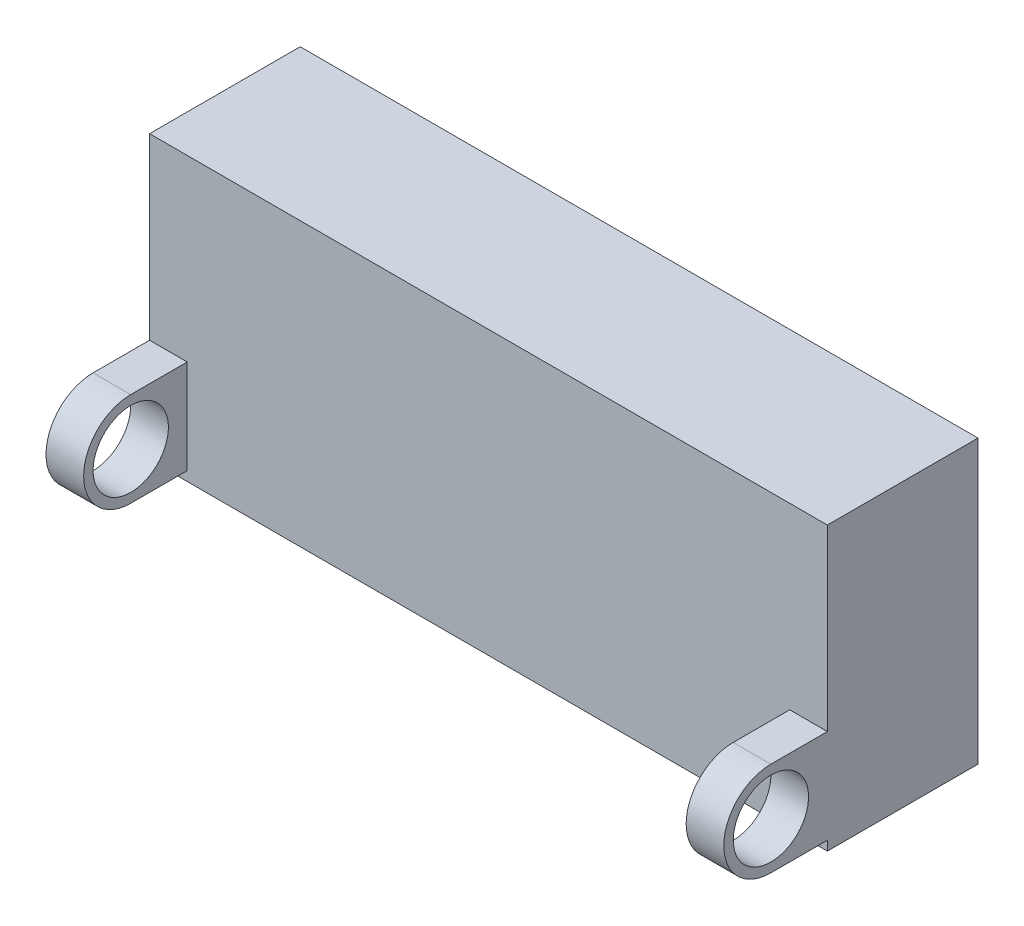
ISO-10303-21;
HEADER;
FILE_DESCRIPTION(('STEP AP214'),'2;1');
FILE_NAME('part.step','',(''),(''),'','','');
FILE_SCHEMA(('AUTOMOTIVE_DESIGN { 1 0 10303 214 1 1 1 1 }'));
ENDSEC;
DATA;
#1=APPLICATION_CONTEXT('core data for automotive mechanical design processes');
#2=APPLICATION_PROTOCOL_DEFINITION('international standard','automotive_design',2000,#1);
#3=PRODUCT_CONTEXT('',#1,'mechanical');
#4=PRODUCT('Part','Part','',(#3));
#5=PRODUCT_RELATED_PRODUCT_CATEGORY('part','',(#4));
#6=PRODUCT_DEFINITION_FORMATION('','',#4);
#7=PRODUCT_DEFINITION_CONTEXT('part definition',#1,'design');
#8=PRODUCT_DEFINITION('design','',#6,#7);
#9=PRODUCT_DEFINITION_SHAPE('','',#8);
#10=(LENGTH_UNIT() NAMED_UNIT(*) SI_UNIT(.MILLI.,.METRE.));
#11=(NAMED_UNIT(*) PLANE_ANGLE_UNIT() SI_UNIT($,.RADIAN.));
#12=(NAMED_UNIT(*) SI_UNIT($,.STERADIAN.) SOLID_ANGLE_UNIT());
#13=UNCERTAINTY_MEASURE_WITH_UNIT(LENGTH_MEASURE(1.E-05),#10,'distance_accuracy_value','');
#14=(GEOMETRIC_REPRESENTATION_CONTEXT(3) GLOBAL_UNCERTAINTY_ASSIGNED_CONTEXT((#13)) GLOBAL_UNIT_ASSIGNED_CONTEXT((#10,
#11,#12)) REPRESENTATION_CONTEXT('',''));
#15=CARTESIAN_POINT('',(0.,0.,0.));
#16=DIRECTION('',(0.,0.,1.));
#17=DIRECTION('',(1.,0.,0.));
#18=AXIS2_PLACEMENT_3D('',#15,#16,#17);
#19=CARTESIAN_POINT('',(0.,15.,8.));
#20=DIRECTION('',(0.,1.,0.));
#21=DIRECTION('',(0.,0.,1.));
#22=AXIS2_PLACEMENT_3D('',#19,#20,#21);
#23=PLANE('',#22);
#24=DIRECTION('',(1.,0.,0.));
#25=VECTOR('',#24,1.);
#26=CARTESIAN_POINT('',(0.,15.,0.));
#27=LINE('',#26,#25);
#28=CARTESIAN_POINT('',(0.,15.,0.));
#29=VERTEX_POINT('',#28);
#30=CARTESIAN_POINT('',(36.,15.,0.));
#31=VERTEX_POINT('',#30);
#32=EDGE_CURVE('E208',#29,#31,#27,.T.);
#33=ORIENTED_EDGE('',*,*,#32,.F.);
#34=DIRECTION('',(0.,0.,-1.));
#35=VECTOR('',#34,1.);
#36=CARTESIAN_POINT('',(0.,15.,8.));
#37=LINE('',#36,#35);
#38=CARTESIAN_POINT('',(0.,15.,8.));
#39=VERTEX_POINT('',#38);
#40=EDGE_CURVE('E13',#39,#29,#37,.T.);
#41=ORIENTED_EDGE('',*,*,#40,.F.);
#42=DIRECTION('',(1.,0.,0.));
#43=VECTOR('',#42,1.);
#44=CARTESIAN_POINT('',(0.,15.,8.));
#45=LINE('',#44,#43);
#46=CARTESIAN_POINT('',(36.,15.,8.));
#47=VERTEX_POINT('',#46);
#48=EDGE_CURVE('E215',#39,#47,#45,.T.);
#49=ORIENTED_EDGE('',*,*,#48,.T.);
#50=DIRECTION('',(0.,0.,-1.));
#51=VECTOR('',#50,1.);
#52=CARTESIAN_POINT('',(36.,15.,8.));
#53=LINE('',#52,#51);
#54=EDGE_CURVE('E51',#47,#31,#53,.T.);
#55=ORIENTED_EDGE('',*,*,#54,.T.);
#56=EDGE_LOOP('',(#33,#41,#49,#55));
#57=FACE_BOUND('',#56,.T.);
#58=ADVANCED_FACE('F48',(#57),#23,.T.);
#59=CARTESIAN_POINT('',(0.,0.,8.));
#60=DIRECTION('',(-1.,0.,0.));
#61=DIRECTION('',(0.,0.,1.));
#62=AXIS2_PLACEMENT_3D('',#59,#60,#61);
#63=PLANE('',#62);
#64=DIRECTION('',(0.,1.,0.));
#65=VECTOR('',#64,1.);
#66=CARTESIAN_POINT('',(0.,0.,0.));
#67=LINE('',#66,#65);
#68=CARTESIAN_POINT('',(0.,0.,0.));
#69=VERTEX_POINT('',#68);
#70=EDGE_CURVE('E218',#69,#29,#67,.T.);
#71=ORIENTED_EDGE('',*,*,#70,.F.);
#72=DIRECTION('',(0.,0.,-1.));
#73=VECTOR('',#72,1.);
#74=CARTESIAN_POINT('',(0.,0.,8.));
#75=LINE('',#74,#73);
#76=CARTESIAN_POINT('',(0.,0.,8.));
#77=VERTEX_POINT('',#76);
#78=EDGE_CURVE('E56',#77,#69,#75,.T.);
#79=ORIENTED_EDGE('',*,*,#78,.F.);
#80=DIRECTION('',(0.,1.,0.));
#81=VECTOR('',#80,1.);
#82=CARTESIAN_POINT('',(0.,0.,8.));
#83=LINE('',#82,#81);
#84=CARTESIAN_POINT('',(0.,0.500000000000002,8.));
#85=VERTEX_POINT('',#84);
#86=EDGE_CURVE('E224',#77,#85,#83,.T.);
#87=ORIENTED_EDGE('',*,*,#86,.T.);
#88=DIRECTION('',(0.,0.,1.));
#89=VECTOR('',#88,1.);
#90=CARTESIAN_POINT('',(0.,0.500000000000002,11.));
#91=LINE('',#90,#89);
#92=CARTESIAN_POINT('',(0.,0.500000000000002,11.));
#93=VERTEX_POINT('',#92);
#94=EDGE_CURVE('E189',#85,#93,#91,.T.);
#95=ORIENTED_EDGE('',*,*,#94,.T.);
#96=CARTESIAN_POINT('',(0.,3.,11.));
#97=DIRECTION('',(-1.,0.,0.));
#98=DIRECTION('',(0.,0.,1.));
#99=AXIS2_PLACEMENT_3D('',#96,#97,#98);
#100=CIRCLE('',#99,2.5);
#101=CARTESIAN_POINT('',(0.,5.5,11.));
#102=VERTEX_POINT('',#101);
#103=EDGE_CURVE('E182',#93,#102,#100,.T.);
#104=ORIENTED_EDGE('',*,*,#103,.T.);
#105=DIRECTION('',(0.,0.,-1.));
#106=VECTOR('',#105,1.);
#107=CARTESIAN_POINT('',(0.,5.5,11.));
#108=LINE('',#107,#106);
#109=CARTESIAN_POINT('',(0.,5.5,8.));
#110=VERTEX_POINT('',#109);
#111=EDGE_CURVE('E201',#102,#110,#108,.T.);
#112=ORIENTED_EDGE('',*,*,#111,.T.);
#113=EDGE_CURVE('E223',#110,#39,#83,.T.);
#114=ORIENTED_EDGE('',*,*,#113,.T.);
#115=ORIENTED_EDGE('',*,*,#40,.T.);
#116=EDGE_LOOP('',(#71,#79,#87,#95,#104,#112,#114,#115));
#117=FACE_BOUND('',#116,.T.);
#118=CARTESIAN_POINT('',(0.,3.,11.));
#119=DIRECTION('',(-1.,0.,0.));
#120=DIRECTION('',(0.,0.,1.));
#121=AXIS2_PLACEMENT_3D('',#118,#119,#120);
#122=CIRCLE('',#121,2.);
#123=CARTESIAN_POINT('',(0.,3.,13.));
#124=VERTEX_POINT('',#123);
#125=EDGE_CURVE('E175',#124,#124,#122,.T.);
#126=ORIENTED_EDGE('',*,*,#125,.F.);
#127=EDGE_LOOP('',(#126));
#128=FACE_BOUND('',#127,.T.);
#129=ADVANCED_FACE('F249',(#117,#128),#63,.T.);
#130=CARTESIAN_POINT('',(0.,0.,8.));
#131=DIRECTION('',(0.,1.,0.));
#132=DIRECTION('',(0.,0.,1.));
#133=AXIS2_PLACEMENT_3D('',#130,#131,#132);
#134=PLANE('',#133);
#135=DIRECTION('',(1.,0.,0.));
#136=VECTOR('',#135,1.);
#137=CARTESIAN_POINT('',(0.,0.,0.));
#138=LINE('',#137,#136);
#139=CARTESIAN_POINT('',(36.,0.,0.));
#140=VERTEX_POINT('',#139);
#141=EDGE_CURVE('E231',#69,#140,#138,.T.);
#142=ORIENTED_EDGE('',*,*,#141,.T.);
#143=DIRECTION('',(0.,0.,-1.));
#144=VECTOR('',#143,1.);
#145=CARTESIAN_POINT('',(36.,0.,8.));
#146=LINE('',#145,#144);
#147=CARTESIAN_POINT('',(36.,0.,8.));
#148=VERTEX_POINT('',#147);
#149=EDGE_CURVE('E235',#148,#140,#146,.T.);
#150=ORIENTED_EDGE('',*,*,#149,.F.);
#151=DIRECTION('',(1.,0.,0.));
#152=VECTOR('',#151,1.);
#153=CARTESIAN_POINT('',(0.,0.,8.));
#154=LINE('',#153,#152);
#155=EDGE_CURVE('E221',#77,#148,#154,.T.);
#156=ORIENTED_EDGE('',*,*,#155,.F.);
#157=ORIENTED_EDGE('',*,*,#78,.T.);
#158=EDGE_LOOP('',(#142,#150,#156,#157));
#159=FACE_BOUND('',#158,.T.);
#160=ADVANCED_FACE('F271',(#159),#134,.F.);
#161=CARTESIAN_POINT('',(36.,0.,8.));
#162=DIRECTION('',(-1.,0.,0.));
#163=DIRECTION('',(0.,0.,1.));
#164=AXIS2_PLACEMENT_3D('',#161,#162,#163);
#165=PLANE('',#164);
#166=DIRECTION('',(0.,1.,0.));
#167=VECTOR('',#166,1.);
#168=CARTESIAN_POINT('',(36.,0.,0.));
#169=LINE('',#168,#167);
#170=EDGE_CURVE('E229',#140,#31,#169,.T.);
#171=ORIENTED_EDGE('',*,*,#170,.T.);
#172=ORIENTED_EDGE('',*,*,#54,.F.);
#173=DIRECTION('',(0.,1.,0.));
#174=VECTOR('',#173,1.);
#175=CARTESIAN_POINT('',(36.,0.,8.));
#176=LINE('',#175,#174);
#177=CARTESIAN_POINT('',(36.,5.5,8.));
#178=VERTEX_POINT('',#177);
#179=EDGE_CURVE('E156',#178,#47,#176,.T.);
#180=ORIENTED_EDGE('',*,*,#179,.F.);
#181=DIRECTION('',(0.,0.,-1.));
#182=VECTOR('',#181,1.);
#183=CARTESIAN_POINT('',(36.,5.5,11.));
#184=LINE('',#183,#182);
#185=CARTESIAN_POINT('',(36.,5.5,11.));
#186=VERTEX_POINT('',#185);
#187=EDGE_CURVE('E138',#186,#178,#184,.T.);
#188=ORIENTED_EDGE('',*,*,#187,.F.);
#189=CARTESIAN_POINT('',(36.,3.,11.));
#190=DIRECTION('',(-1.,0.,0.));
#191=DIRECTION('',(0.,0.,1.));
#192=AXIS2_PLACEMENT_3D('',#189,#190,#191);
#193=CIRCLE('',#192,2.5);
#194=CARTESIAN_POINT('',(36.,0.500000000000003,11.));
#195=VERTEX_POINT('',#194);
#196=EDGE_CURVE('E153',#195,#186,#193,.T.);
#197=ORIENTED_EDGE('',*,*,#196,.F.);
#198=DIRECTION('',(0.,0.,1.));
#199=VECTOR('',#198,1.);
#200=CARTESIAN_POINT('',(36.,0.500000000000003,11.));
#201=LINE('',#200,#199);
#202=CARTESIAN_POINT('',(36.,0.500000000000001,8.));
#203=VERTEX_POINT('',#202);
#204=EDGE_CURVE('E145',#203,#195,#201,.T.);
#205=ORIENTED_EDGE('',*,*,#204,.F.);
#206=EDGE_CURVE('E219',#148,#203,#176,.T.);
#207=ORIENTED_EDGE('',*,*,#206,.F.);
#208=ORIENTED_EDGE('',*,*,#149,.T.);
#209=EDGE_LOOP('',(#171,#172,#180,#188,#197,#205,#207,#208));
#210=FACE_BOUND('',#209,.T.);
#211=CARTESIAN_POINT('',(36.,3.,11.));
#212=DIRECTION('',(-1.,0.,0.));
#213=DIRECTION('',(0.,0.,1.));
#214=AXIS2_PLACEMENT_3D('',#211,#212,#213);
#215=CIRCLE('',#214,2.);
#216=CARTESIAN_POINT('',(36.,3.,13.));
#217=VERTEX_POINT('',#216);
#218=EDGE_CURVE('E171',#217,#217,#215,.T.);
#219=ORIENTED_EDGE('',*,*,#218,.T.);
#220=EDGE_LOOP('',(#219));
#221=FACE_BOUND('',#220,.T.);
#222=ADVANCED_FACE('F150',(#210,#221),#165,.F.);
#223=CARTESIAN_POINT('',(0.,0.,8.));
#224=DIRECTION('',(0.,0.,1.));
#225=DIRECTION('',(1.,0.,0.));
#226=AXIS2_PLACEMENT_3D('',#223,#224,#225);
#227=PLANE('',#226);
#228=DIRECTION('',(-1.,0.,0.));
#229=VECTOR('',#228,1.);
#230=CARTESIAN_POINT('',(36.,0.500000000000001,8.));
#231=LINE('',#230,#229);
#232=CARTESIAN_POINT('',(34.,0.500000000000001,8.));
#233=VERTEX_POINT('',#232);
#234=EDGE_CURVE('E176',#203,#233,#231,.T.);
#235=ORIENTED_EDGE('',*,*,#234,.T.);
#236=DIRECTION('',(0.,-1.,0.));
#237=VECTOR('',#236,1.);
#238=CARTESIAN_POINT('',(34.,0.500000000000001,8.));
#239=LINE('',#238,#237);
#240=CARTESIAN_POINT('',(34.,5.5,8.));
#241=VERTEX_POINT('',#240);
#242=EDGE_CURVE('E64',#241,#233,#239,.T.);
#243=ORIENTED_EDGE('',*,*,#242,.F.);
#244=DIRECTION('',(-1.,0.,0.));
#245=VECTOR('',#244,1.);
#246=CARTESIAN_POINT('',(36.,5.5,8.));
#247=LINE('',#246,#245);
#248=EDGE_CURVE('E68',#178,#241,#247,.T.);
#249=ORIENTED_EDGE('',*,*,#248,.F.);
#250=ORIENTED_EDGE('',*,*,#179,.T.);
#251=ORIENTED_EDGE('',*,*,#48,.F.);
#252=ORIENTED_EDGE('',*,*,#113,.F.);
#253=DIRECTION('',(-1.,0.,0.));
#254=VECTOR('',#253,1.);
#255=CARTESIAN_POINT('',(2.,5.5,8.));
#256=LINE('',#255,#254);
#257=CARTESIAN_POINT('',(2.,5.5,8.));
#258=VERTEX_POINT('',#257);
#259=EDGE_CURVE('E212',#258,#110,#256,.T.);
#260=ORIENTED_EDGE('',*,*,#259,.F.);
#261=DIRECTION('',(0.,-1.,0.));
#262=VECTOR('',#261,1.);
#263=CARTESIAN_POINT('',(2.,0.500000000000002,8.));
#264=LINE('',#263,#262);
#265=CARTESIAN_POINT('',(2.,0.500000000000002,8.));
#266=VERTEX_POINT('',#265);
#267=EDGE_CURVE('E192',#258,#266,#264,.T.);
#268=ORIENTED_EDGE('',*,*,#267,.T.);
#269=DIRECTION('',(-1.,0.,0.));
#270=VECTOR('',#269,1.);
#271=CARTESIAN_POINT('',(2.,0.500000000000002,8.));
#272=LINE('',#271,#270);
#273=EDGE_CURVE('E209',#266,#85,#272,.T.);
#274=ORIENTED_EDGE('',*,*,#273,.T.);
#275=ORIENTED_EDGE('',*,*,#86,.F.);
#276=ORIENTED_EDGE('',*,*,#155,.T.);
#277=ORIENTED_EDGE('',*,*,#206,.T.);
#278=EDGE_LOOP('',(#235,#243,#249,#250,#251,#252,#260,#268,#274,#275,#276,#277));
#279=FACE_BOUND('',#278,.T.);
#280=ADVANCED_FACE('F253',(#279),#227,.T.);
#281=CARTESIAN_POINT('',(0.,0.,0.));
#282=DIRECTION('',(0.,0.,1.));
#283=DIRECTION('',(1.,0.,0.));
#284=AXIS2_PLACEMENT_3D('',#281,#282,#283);
#285=PLANE('',#284);
#286=ORIENTED_EDGE('',*,*,#32,.T.);
#287=ORIENTED_EDGE('',*,*,#170,.F.);
#288=ORIENTED_EDGE('',*,*,#141,.F.);
#289=ORIENTED_EDGE('',*,*,#70,.T.);
#290=EDGE_LOOP('',(#286,#287,#288,#289));
#291=FACE_BOUND('',#290,.T.);
#292=ADVANCED_FACE('F246',(#291),#285,.F.);
#293=CARTESIAN_POINT('',(2.,3.,11.));
#294=DIRECTION('',(-1.,0.,0.));
#295=DIRECTION('',(0.,0.,1.));
#296=AXIS2_PLACEMENT_3D('',#293,#294,#295);
#297=CYLINDRICAL_SURFACE('',#296,2.5);
#298=ORIENTED_EDGE('',*,*,#103,.F.);
#299=DIRECTION('',(-1.,0.,0.));
#300=VECTOR('',#299,1.);
#301=CARTESIAN_POINT('',(2.,0.500000000000002,11.));
#302=LINE('',#301,#300);
#303=CARTESIAN_POINT('',(2.,0.500000000000002,11.));
#304=VERTEX_POINT('',#303);
#305=EDGE_CURVE('E206',#304,#93,#302,.T.);
#306=ORIENTED_EDGE('',*,*,#305,.F.);
#307=CARTESIAN_POINT('',(2.,3.,11.));
#308=DIRECTION('',(-1.,0.,0.));
#309=DIRECTION('',(0.,0.,1.));
#310=AXIS2_PLACEMENT_3D('',#307,#308,#309);
#311=CIRCLE('',#310,2.5);
#312=CARTESIAN_POINT('',(2.,5.5,11.));
#313=VERTEX_POINT('',#312);
#314=EDGE_CURVE('E185',#304,#313,#311,.T.);
#315=ORIENTED_EDGE('',*,*,#314,.T.);
#316=DIRECTION('',(-1.,0.,0.));
#317=VECTOR('',#316,1.);
#318=CARTESIAN_POINT('',(2.,5.5,11.));
#319=LINE('',#318,#317);
#320=EDGE_CURVE('E198',#313,#102,#319,.T.);
#321=ORIENTED_EDGE('',*,*,#320,.T.);
#322=EDGE_LOOP('',(#298,#306,#315,#321));
#323=FACE_BOUND('',#322,.T.);
#324=ADVANCED_FACE('F261',(#323),#297,.T.);
#325=CARTESIAN_POINT('',(2.,0.500000000000002,11.));
#326=DIRECTION('',(0.,-1.,0.));
#327=DIRECTION('',(0.,0.,-1.));
#328=AXIS2_PLACEMENT_3D('',#325,#326,#327);
#329=PLANE('',#328);
#330=ORIENTED_EDGE('',*,*,#94,.F.);
#331=ORIENTED_EDGE('',*,*,#273,.F.);
#332=DIRECTION('',(0.,0.,1.));
#333=VECTOR('',#332,1.);
#334=CARTESIAN_POINT('',(2.,0.500000000000002,11.));
#335=LINE('',#334,#333);
#336=EDGE_CURVE('E195',#266,#304,#335,.T.);
#337=ORIENTED_EDGE('',*,*,#336,.T.);
#338=ORIENTED_EDGE('',*,*,#305,.T.);
#339=EDGE_LOOP('',(#330,#331,#337,#338));
#340=FACE_BOUND('',#339,.T.);
#341=ADVANCED_FACE('F267',(#340),#329,.T.);
#342=CARTESIAN_POINT('',(2.,5.5,11.));
#343=DIRECTION('',(0.,1.,0.));
#344=DIRECTION('',(0.,0.,1.));
#345=AXIS2_PLACEMENT_3D('',#342,#343,#344);
#346=PLANE('',#345);
#347=ORIENTED_EDGE('',*,*,#111,.F.);
#348=ORIENTED_EDGE('',*,*,#320,.F.);
#349=DIRECTION('',(0.,0.,-1.));
#350=VECTOR('',#349,1.);
#351=CARTESIAN_POINT('',(2.,5.5,11.));
#352=LINE('',#351,#350);
#353=EDGE_CURVE('E188',#313,#258,#352,.T.);
#354=ORIENTED_EDGE('',*,*,#353,.T.);
#355=ORIENTED_EDGE('',*,*,#259,.T.);
#356=EDGE_LOOP('',(#347,#348,#354,#355));
#357=FACE_BOUND('',#356,.T.);
#358=ADVANCED_FACE('F257',(#357),#346,.T.);
#359=CARTESIAN_POINT('',(2.,3.,11.));
#360=DIRECTION('',(-1.,0.,0.));
#361=DIRECTION('',(0.,0.,1.));
#362=AXIS2_PLACEMENT_3D('',#359,#360,#361);
#363=PLANE('',#362);
#364=CARTESIAN_POINT('',(2.,3.,11.));
#365=DIRECTION('',(-1.,0.,0.));
#366=DIRECTION('',(0.,0.,1.));
#367=AXIS2_PLACEMENT_3D('',#364,#365,#366);
#368=CIRCLE('',#367,2.);
#369=CARTESIAN_POINT('',(2.,3.,13.));
#370=VERTEX_POINT('',#369);
#371=EDGE_CURVE('E179',#370,#370,#368,.T.);
#372=ORIENTED_EDGE('',*,*,#371,.T.);
#373=EDGE_LOOP('',(#372));
#374=FACE_BOUND('',#373,.T.);
#375=ORIENTED_EDGE('',*,*,#314,.F.);
#376=ORIENTED_EDGE('',*,*,#336,.F.);
#377=ORIENTED_EDGE('',*,*,#267,.F.);
#378=ORIENTED_EDGE('',*,*,#353,.F.);
#379=EDGE_LOOP('',(#375,#376,#377,#378));
#380=FACE_BOUND('',#379,.T.);
#381=ADVANCED_FACE('F264',(#374,#380),#363,.F.);
#382=CARTESIAN_POINT('',(2.,3.,11.));
#383=DIRECTION('',(-1.,0.,0.));
#384=DIRECTION('',(0.,0.,1.));
#385=AXIS2_PLACEMENT_3D('',#382,#383,#384);
#386=CYLINDRICAL_SURFACE('',#385,2.);
#387=ORIENTED_EDGE('',*,*,#371,.F.);
#388=EDGE_LOOP('',(#387));
#389=FACE_BOUND('',#388,.T.);
#390=ORIENTED_EDGE('',*,*,#125,.T.);
#391=EDGE_LOOP('',(#390));
#392=FACE_BOUND('',#391,.T.);
#393=ADVANCED_FACE('F317',(#389,#392),#386,.F.);
#394=CARTESIAN_POINT('',(36.,3.,11.));
#395=DIRECTION('',(-1.,0.,0.));
#396=DIRECTION('',(0.,0.,1.));
#397=AXIS2_PLACEMENT_3D('',#394,#395,#396);
#398=CYLINDRICAL_SURFACE('',#397,2.5);
#399=CARTESIAN_POINT('',(34.,3.,11.));
#400=DIRECTION('',(-1.,0.,0.));
#401=DIRECTION('',(0.,0.,1.));
#402=AXIS2_PLACEMENT_3D('',#399,#400,#401);
#403=CIRCLE('',#402,2.5);
#404=CARTESIAN_POINT('',(34.,0.500000000000003,11.));
#405=VERTEX_POINT('',#404);
#406=CARTESIAN_POINT('',(34.,5.5,11.));
#407=VERTEX_POINT('',#406);
#408=EDGE_CURVE('E169',#405,#407,#403,.T.);
#409=ORIENTED_EDGE('',*,*,#408,.F.);
#410=DIRECTION('',(-1.,0.,0.));
#411=VECTOR('',#410,1.);
#412=CARTESIAN_POINT('',(36.,0.500000000000003,11.));
#413=LINE('',#412,#411);
#414=EDGE_CURVE('E159',#195,#405,#413,.T.);
#415=ORIENTED_EDGE('',*,*,#414,.F.);
#416=ORIENTED_EDGE('',*,*,#196,.T.);
#417=DIRECTION('',(-1.,0.,0.));
#418=VECTOR('',#417,1.);
#419=CARTESIAN_POINT('',(36.,5.5,11.));
#420=LINE('',#419,#418);
#421=EDGE_CURVE('E135',#186,#407,#420,.T.);
#422=ORIENTED_EDGE('',*,*,#421,.T.);
#423=EDGE_LOOP('',(#409,#415,#416,#422));
#424=FACE_BOUND('',#423,.T.);
#425=ADVANCED_FACE('F158',(#424),#398,.T.);
#426=CARTESIAN_POINT('',(36.,0.500000000000003,11.));
#427=DIRECTION('',(0.,-1.,0.));
#428=DIRECTION('',(0.,0.,-1.));
#429=AXIS2_PLACEMENT_3D('',#426,#427,#428);
#430=PLANE('',#429);
#431=DIRECTION('',(0.,0.,1.));
#432=VECTOR('',#431,1.);
#433=CARTESIAN_POINT('',(34.,0.500000000000003,11.));
#434=LINE('',#433,#432);
#435=EDGE_CURVE('E160',#233,#405,#434,.T.);
#436=ORIENTED_EDGE('',*,*,#435,.F.);
#437=ORIENTED_EDGE('',*,*,#234,.F.);
#438=ORIENTED_EDGE('',*,*,#204,.T.);
#439=ORIENTED_EDGE('',*,*,#414,.T.);
#440=EDGE_LOOP('',(#436,#437,#438,#439));
#441=FACE_BOUND('',#440,.T.);
#442=ADVANCED_FACE('F274',(#441),#430,.T.);
#443=CARTESIAN_POINT('',(36.,5.5,11.));
#444=DIRECTION('',(0.,1.,0.));
#445=DIRECTION('',(0.,0.,1.));
#446=AXIS2_PLACEMENT_3D('',#443,#444,#445);
#447=PLANE('',#446);
#448=DIRECTION('',(0.,0.,-1.));
#449=VECTOR('',#448,1.);
#450=CARTESIAN_POINT('',(34.,5.5,11.));
#451=LINE('',#450,#449);
#452=EDGE_CURVE('E140',#407,#241,#451,.T.);
#453=ORIENTED_EDGE('',*,*,#452,.F.);
#454=ORIENTED_EDGE('',*,*,#421,.F.);
#455=ORIENTED_EDGE('',*,*,#187,.T.);
#456=ORIENTED_EDGE('',*,*,#248,.T.);
#457=EDGE_LOOP('',(#453,#454,#455,#456));
#458=FACE_BOUND('',#457,.T.);
#459=ADVANCED_FACE('F137',(#458),#447,.T.);
#460=CARTESIAN_POINT('',(34.,3.,11.));
#461=DIRECTION('',(-1.,0.,0.));
#462=DIRECTION('',(0.,0.,1.));
#463=AXIS2_PLACEMENT_3D('',#460,#461,#462);
#464=PLANE('',#463);
#465=CARTESIAN_POINT('',(34.,3.,11.));
#466=DIRECTION('',(-1.,0.,0.));
#467=DIRECTION('',(0.,0.,1.));
#468=AXIS2_PLACEMENT_3D('',#465,#466,#467);
#469=CIRCLE('',#468,2.);
#470=CARTESIAN_POINT('',(34.,3.,13.));
#471=VERTEX_POINT('',#470);
#472=EDGE_CURVE('E165',#471,#471,#469,.T.);
#473=ORIENTED_EDGE('',*,*,#472,.F.);
#474=EDGE_LOOP('',(#473));
#475=FACE_BOUND('',#474,.T.);
#476=ORIENTED_EDGE('',*,*,#408,.T.);
#477=ORIENTED_EDGE('',*,*,#452,.T.);
#478=ORIENTED_EDGE('',*,*,#242,.T.);
#479=ORIENTED_EDGE('',*,*,#435,.T.);
#480=EDGE_LOOP('',(#476,#477,#478,#479));
#481=FACE_BOUND('',#480,.T.);
#482=ADVANCED_FACE('F276',(#475,#481),#464,.T.);
#483=CARTESIAN_POINT('',(36.,3.,11.));
#484=DIRECTION('',(-1.,0.,0.));
#485=DIRECTION('',(0.,0.,1.));
#486=AXIS2_PLACEMENT_3D('',#483,#484,#485);
#487=CYLINDRICAL_SURFACE('',#486,2.);
#488=ORIENTED_EDGE('',*,*,#218,.F.);
#489=EDGE_LOOP('',(#488));
#490=FACE_BOUND('',#489,.T.);
#491=ORIENTED_EDGE('',*,*,#472,.T.);
#492=EDGE_LOOP('',(#491));
#493=FACE_BOUND('',#492,.T.);
#494=ADVANCED_FACE('F278',(#490,#493),#487,.F.);
#495=CLOSED_SHELL('',(#58,#129,#160,#222,#280,#292,#324,#341,#358,#381,#393,#425,#442,#459,#482,#494));
#496=MANIFOLD_SOLID_BREP('B2',#495);
#497=ADVANCED_BREP_SHAPE_REPRESENTATION('',(#18,#496),#14);
#498=SHAPE_DEFINITION_REPRESENTATION(#9,#497);
ENDSEC;
END-ISO-10303-21;
